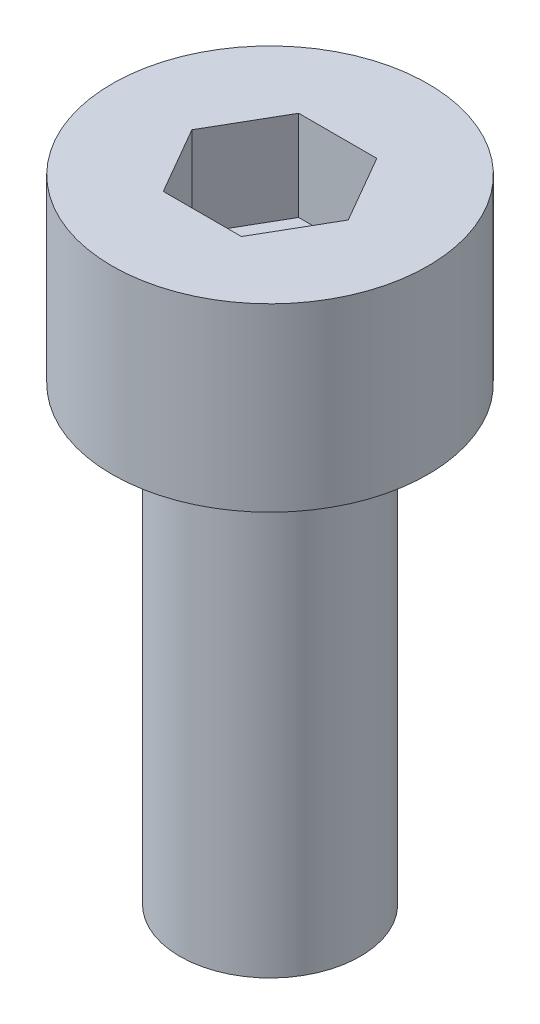
ISO-10303-21;
HEADER;
FILE_DESCRIPTION(('STEP AP214'),'2;1');
FILE_NAME('part.step','',(''),(''),'','','');
FILE_SCHEMA(('AUTOMOTIVE_DESIGN { 1 0 10303 214 1 1 1 1 }'));
ENDSEC;
DATA;
#1=APPLICATION_CONTEXT('core data for automotive mechanical design processes');
#2=APPLICATION_PROTOCOL_DEFINITION('international standard','automotive_design',2000,#1);
#3=PRODUCT_CONTEXT('',#1,'mechanical');
#4=PRODUCT('Part','Part','',(#3));
#5=PRODUCT_RELATED_PRODUCT_CATEGORY('part','',(#4));
#6=PRODUCT_DEFINITION_FORMATION('','',#4);
#7=PRODUCT_DEFINITION_CONTEXT('part definition',#1,'design');
#8=PRODUCT_DEFINITION('design','',#6,#7);
#9=PRODUCT_DEFINITION_SHAPE('','',#8);
#10=(LENGTH_UNIT() NAMED_UNIT(*) SI_UNIT(.MILLI.,.METRE.));
#11=(NAMED_UNIT(*) PLANE_ANGLE_UNIT() SI_UNIT($,.RADIAN.));
#12=(NAMED_UNIT(*) SI_UNIT($,.STERADIAN.) SOLID_ANGLE_UNIT());
#13=UNCERTAINTY_MEASURE_WITH_UNIT(LENGTH_MEASURE(1.E-05),#10,'distance_accuracy_value','');
#14=(GEOMETRIC_REPRESENTATION_CONTEXT(3) GLOBAL_UNCERTAINTY_ASSIGNED_CONTEXT((#13)) GLOBAL_UNIT_ASSIGNED_CONTEXT((#10,
#11,#12)) REPRESENTATION_CONTEXT('',''));
#15=CARTESIAN_POINT('',(0.,0.,0.));
#16=DIRECTION('',(0.,0.,1.));
#17=DIRECTION('',(1.,0.,0.));
#18=AXIS2_PLACEMENT_3D('',#15,#16,#17);
#19=CARTESIAN_POINT('',(0.,4.,0.));
#20=DIRECTION('',(0.,-1.,0.));
#21=DIRECTION('',(0.,0.,-1.));
#22=AXIS2_PLACEMENT_3D('',#19,#20,#21);
#23=CYLINDRICAL_SURFACE('',#22,3.5);
#24=CARTESIAN_POINT('',(0.,4.,0.));
#25=DIRECTION('',(0.,1.,0.));
#26=DIRECTION('',(0.,0.,1.));
#27=AXIS2_PLACEMENT_3D('',#24,#25,#26);
#28=CIRCLE('',#27,3.5);
#29=CARTESIAN_POINT('',(0.,4.,3.5));
#30=VERTEX_POINT('',#29);
#31=EDGE_CURVE('E47',#30,#30,#28,.T.);
#32=ORIENTED_EDGE('',*,*,#31,.F.);
#33=EDGE_LOOP('',(#32));
#34=FACE_BOUND('',#33,.T.);
#35=CARTESIAN_POINT('',(0.,0.,0.));
#36=DIRECTION('',(0.,1.,0.));
#37=DIRECTION('',(0.,0.,1.));
#38=AXIS2_PLACEMENT_3D('',#35,#36,#37);
#39=CIRCLE('',#38,3.5);
#40=CARTESIAN_POINT('',(0.,0.,3.5));
#41=VERTEX_POINT('',#40);
#42=EDGE_CURVE('E42',#41,#41,#39,.T.);
#43=ORIENTED_EDGE('',*,*,#42,.T.);
#44=EDGE_LOOP('',(#43));
#45=FACE_BOUND('',#44,.T.);
#46=ADVANCED_FACE('F39',(#34,#45),#23,.T.);
#47=CARTESIAN_POINT('',(0.,4.,0.));
#48=DIRECTION('',(0.,1.,0.));
#49=DIRECTION('',(0.,0.,1.));
#50=AXIS2_PLACEMENT_3D('',#47,#48,#49);
#51=PLANE('',#50);
#52=DIRECTION('',(0.5,0.,-0.866025403784439));
#53=VECTOR('',#52,1.);
#54=CARTESIAN_POINT('',(0.866025403784438,4.,1.5));
#55=LINE('',#54,#53);
#56=CARTESIAN_POINT('',(0.866025403784438,4.,1.5));
#57=VERTEX_POINT('',#56);
#58=CARTESIAN_POINT('',(1.73205080756888,4.,0.));
#59=VERTEX_POINT('',#58);
#60=EDGE_CURVE('E55',#57,#59,#55,.T.);
#61=ORIENTED_EDGE('',*,*,#60,.F.);
#62=DIRECTION('',(1.,0.,0.));
#63=VECTOR('',#62,1.);
#64=CARTESIAN_POINT('',(-0.866025403784439,4.,1.5));
#65=LINE('',#64,#63);
#66=CARTESIAN_POINT('',(-0.866025403784439,4.,1.5));
#67=VERTEX_POINT('',#66);
#68=EDGE_CURVE('E139',#67,#57,#65,.T.);
#69=ORIENTED_EDGE('',*,*,#68,.F.);
#70=DIRECTION('',(0.5,0.,0.866025403784438));
#71=VECTOR('',#70,1.);
#72=CARTESIAN_POINT('',(-1.73205080756888,4.,0.));
#73=LINE('',#72,#71);
#74=CARTESIAN_POINT('',(-1.73205080756888,4.,0.));
#75=VERTEX_POINT('',#74);
#76=EDGE_CURVE('E137',#75,#67,#73,.T.);
#77=ORIENTED_EDGE('',*,*,#76,.F.);
#78=DIRECTION('',(-0.5,0.,0.866025403784439));
#79=VECTOR('',#78,1.);
#80=CARTESIAN_POINT('',(-0.866025403784439,4.,-1.5));
#81=LINE('',#80,#79);
#82=CARTESIAN_POINT('',(-0.866025403784439,4.,-1.5));
#83=VERTEX_POINT('',#82);
#84=EDGE_CURVE('E103',#83,#75,#81,.T.);
#85=ORIENTED_EDGE('',*,*,#84,.F.);
#86=DIRECTION('',(-1.,0.,0.));
#87=VECTOR('',#86,1.);
#88=CARTESIAN_POINT('',(0.866025403784438,4.,-1.5));
#89=LINE('',#88,#87);
#90=CARTESIAN_POINT('',(0.866025403784438,4.,-1.5));
#91=VERTEX_POINT('',#90);
#92=EDGE_CURVE('E133',#91,#83,#89,.T.);
#93=ORIENTED_EDGE('',*,*,#92,.F.);
#94=DIRECTION('',(-0.5,0.,-0.866025403784439));
#95=VECTOR('',#94,1.);
#96=CARTESIAN_POINT('',(1.73205080756888,4.,0.));
#97=LINE('',#96,#95);
#98=EDGE_CURVE('E129',#59,#91,#97,.T.);
#99=ORIENTED_EDGE('',*,*,#98,.F.);
#100=EDGE_LOOP('',(#61,#69,#77,#85,#93,#99));
#101=FACE_BOUND('',#100,.T.);
#102=ORIENTED_EDGE('',*,*,#31,.T.);
#103=EDGE_LOOP('',(#102));
#104=FACE_BOUND('',#103,.T.);
#105=ADVANCED_FACE('F157',(#101,#104),#51,.T.);
#106=CARTESIAN_POINT('',(0.,0.,0.));
#107=DIRECTION('',(0.,1.,0.));
#108=DIRECTION('',(0.,0.,1.));
#109=AXIS2_PLACEMENT_3D('',#106,#107,#108);
#110=PLANE('',#109);
#111=CARTESIAN_POINT('',(0.,0.,0.));
#112=DIRECTION('',(0.,-1.,0.));
#113=DIRECTION('',(0.,0.,-1.));
#114=AXIS2_PLACEMENT_3D('',#111,#112,#113);
#115=CIRCLE('',#114,2.);
#116=CARTESIAN_POINT('',(0.,0.,-2.));
#117=VERTEX_POINT('',#116);
#118=EDGE_CURVE('E11',#117,#117,#115,.T.);
#119=ORIENTED_EDGE('',*,*,#118,.F.);
#120=EDGE_LOOP('',(#119));
#121=FACE_BOUND('',#120,.T.);
#122=ORIENTED_EDGE('',*,*,#42,.F.);
#123=EDGE_LOOP('',(#122));
#124=FACE_BOUND('',#123,.T.);
#125=ADVANCED_FACE('F154',(#121,#124),#110,.F.);
#126=CARTESIAN_POINT('',(0.866025403784438,2.,1.5));
#127=DIRECTION('',(0.866025403784439,0.,0.5));
#128=DIRECTION('',(0.5,0.,-0.866025403784439));
#129=AXIS2_PLACEMENT_3D('',#126,#127,#128);
#130=PLANE('',#129);
#131=ORIENTED_EDGE('',*,*,#60,.T.);
#132=DIRECTION('',(0.,1.,0.));
#133=VECTOR('',#132,1.);
#134=CARTESIAN_POINT('',(1.73205080756888,2.,0.));
#135=LINE('',#134,#133);
#136=CARTESIAN_POINT('',(1.73205080756888,2.,0.));
#137=VERTEX_POINT('',#136);
#138=EDGE_CURVE('E85',#137,#59,#135,.T.);
#139=ORIENTED_EDGE('',*,*,#138,.F.);
#140=DIRECTION('',(0.5,0.,-0.866025403784439));
#141=VECTOR('',#140,1.);
#142=CARTESIAN_POINT('',(0.866025403784438,2.,1.5));
#143=LINE('',#142,#141);
#144=CARTESIAN_POINT('',(0.866025403784438,2.,1.5));
#145=VERTEX_POINT('',#144);
#146=EDGE_CURVE('E141',#145,#137,#143,.T.);
#147=ORIENTED_EDGE('',*,*,#146,.F.);
#148=DIRECTION('',(0.,1.,0.));
#149=VECTOR('',#148,1.);
#150=CARTESIAN_POINT('',(0.866025403784438,2.,1.5));
#151=LINE('',#150,#149);
#152=EDGE_CURVE('E63',#145,#57,#151,.T.);
#153=ORIENTED_EDGE('',*,*,#152,.T.);
#154=EDGE_LOOP('',(#131,#139,#147,#153));
#155=FACE_BOUND('',#154,.T.);
#156=ADVANCED_FACE('F156',(#155),#130,.F.);
#157=CARTESIAN_POINT('',(-0.866025403784439,2.,1.5));
#158=DIRECTION('',(0.,0.,1.));
#159=DIRECTION('',(1.,0.,0.));
#160=AXIS2_PLACEMENT_3D('',#157,#158,#159);
#161=PLANE('',#160);
#162=ORIENTED_EDGE('',*,*,#68,.T.);
#163=ORIENTED_EDGE('',*,*,#152,.F.);
#164=DIRECTION('',(1.,0.,0.));
#165=VECTOR('',#164,1.);
#166=CARTESIAN_POINT('',(-0.866025403784439,2.,1.5));
#167=LINE('',#166,#165);
#168=CARTESIAN_POINT('',(-0.866025403784439,2.,1.5));
#169=VERTEX_POINT('',#168);
#170=EDGE_CURVE('E115',#169,#145,#167,.T.);
#171=ORIENTED_EDGE('',*,*,#170,.F.);
#172=DIRECTION('',(0.,1.,0.));
#173=VECTOR('',#172,1.);
#174=CARTESIAN_POINT('',(-0.866025403784439,2.,1.5));
#175=LINE('',#174,#173);
#176=EDGE_CURVE('E107',#169,#67,#175,.T.);
#177=ORIENTED_EDGE('',*,*,#176,.T.);
#178=EDGE_LOOP('',(#162,#163,#171,#177));
#179=FACE_BOUND('',#178,.T.);
#180=ADVANCED_FACE('F163',(#179),#161,.F.);
#181=CARTESIAN_POINT('',(-1.73205080756888,2.,0.));
#182=DIRECTION('',(-0.866025403784439,0.,0.5));
#183=DIRECTION('',(0.5,0.,0.866025403784438));
#184=AXIS2_PLACEMENT_3D('',#181,#182,#183);
#185=PLANE('',#184);
#186=ORIENTED_EDGE('',*,*,#76,.T.);
#187=ORIENTED_EDGE('',*,*,#176,.F.);
#188=DIRECTION('',(0.5,0.,0.866025403784438));
#189=VECTOR('',#188,1.);
#190=CARTESIAN_POINT('',(-1.73205080756888,2.,0.));
#191=LINE('',#190,#189);
#192=CARTESIAN_POINT('',(-1.73205080756888,2.,0.));
#193=VERTEX_POINT('',#192);
#194=EDGE_CURVE('E111',#193,#169,#191,.T.);
#195=ORIENTED_EDGE('',*,*,#194,.F.);
#196=DIRECTION('',(0.,1.,0.));
#197=VECTOR('',#196,1.);
#198=CARTESIAN_POINT('',(-1.73205080756888,2.,0.));
#199=LINE('',#198,#197);
#200=EDGE_CURVE('E96',#193,#75,#199,.T.);
#201=ORIENTED_EDGE('',*,*,#200,.T.);
#202=EDGE_LOOP('',(#186,#187,#195,#201));
#203=FACE_BOUND('',#202,.T.);
#204=ADVANCED_FACE('F112',(#203),#185,.F.);
#205=CARTESIAN_POINT('',(-0.866025403784439,2.,-1.5));
#206=DIRECTION('',(-0.866025403784439,0.,-0.5));
#207=DIRECTION('',(-0.5,0.,0.866025403784439));
#208=AXIS2_PLACEMENT_3D('',#205,#206,#207);
#209=PLANE('',#208);
#210=ORIENTED_EDGE('',*,*,#84,.T.);
#211=ORIENTED_EDGE('',*,*,#200,.F.);
#212=DIRECTION('',(-0.5,0.,0.866025403784439));
#213=VECTOR('',#212,1.);
#214=CARTESIAN_POINT('',(-0.866025403784439,2.,-1.5));
#215=LINE('',#214,#213);
#216=CARTESIAN_POINT('',(-0.866025403784439,2.,-1.5));
#217=VERTEX_POINT('',#216);
#218=EDGE_CURVE('E100',#217,#193,#215,.T.);
#219=ORIENTED_EDGE('',*,*,#218,.F.);
#220=DIRECTION('',(0.,1.,0.));
#221=VECTOR('',#220,1.);
#222=CARTESIAN_POINT('',(-0.866025403784439,2.,-1.5));
#223=LINE('',#222,#221);
#224=EDGE_CURVE('E108',#217,#83,#223,.T.);
#225=ORIENTED_EDGE('',*,*,#224,.T.);
#226=EDGE_LOOP('',(#210,#211,#219,#225));
#227=FACE_BOUND('',#226,.T.);
#228=ADVANCED_FACE('F98',(#227),#209,.F.);
#229=CARTESIAN_POINT('',(0.866025403784438,2.,-1.5));
#230=DIRECTION('',(0.,0.,-1.));
#231=DIRECTION('',(-1.,0.,0.));
#232=AXIS2_PLACEMENT_3D('',#229,#230,#231);
#233=PLANE('',#232);
#234=ORIENTED_EDGE('',*,*,#92,.T.);
#235=ORIENTED_EDGE('',*,*,#224,.F.);
#236=DIRECTION('',(-1.,0.,0.));
#237=VECTOR('',#236,1.);
#238=CARTESIAN_POINT('',(0.866025403784438,2.,-1.5));
#239=LINE('',#238,#237);
#240=CARTESIAN_POINT('',(0.866025403784438,2.,-1.5));
#241=VERTEX_POINT('',#240);
#242=EDGE_CURVE('E121',#241,#217,#239,.T.);
#243=ORIENTED_EDGE('',*,*,#242,.F.);
#244=DIRECTION('',(0.,1.,0.));
#245=VECTOR('',#244,1.);
#246=CARTESIAN_POINT('',(0.866025403784438,2.,-1.5));
#247=LINE('',#246,#245);
#248=EDGE_CURVE('E145',#241,#91,#247,.T.);
#249=ORIENTED_EDGE('',*,*,#248,.T.);
#250=EDGE_LOOP('',(#234,#235,#243,#249));
#251=FACE_BOUND('',#250,.T.);
#252=ADVANCED_FACE('F208',(#251),#233,.F.);
#253=CARTESIAN_POINT('',(1.73205080756888,2.,0.));
#254=DIRECTION('',(0.866025403784439,0.,-0.5));
#255=DIRECTION('',(-0.5,0.,-0.866025403784439));
#256=AXIS2_PLACEMENT_3D('',#253,#254,#255);
#257=PLANE('',#256);
#258=ORIENTED_EDGE('',*,*,#98,.T.);
#259=ORIENTED_EDGE('',*,*,#248,.F.);
#260=DIRECTION('',(-0.5,0.,-0.866025403784439));
#261=VECTOR('',#260,1.);
#262=CARTESIAN_POINT('',(1.73205080756888,2.,0.));
#263=LINE('',#262,#261);
#264=EDGE_CURVE('E123',#137,#241,#263,.T.);
#265=ORIENTED_EDGE('',*,*,#264,.F.);
#266=ORIENTED_EDGE('',*,*,#138,.T.);
#267=EDGE_LOOP('',(#258,#259,#265,#266));
#268=FACE_BOUND('',#267,.T.);
#269=ADVANCED_FACE('F217',(#268),#257,.F.);
#270=CARTESIAN_POINT('',(0.,2.,0.));
#271=DIRECTION('',(0.,1.,0.));
#272=DIRECTION('',(0.,0.,1.));
#273=AXIS2_PLACEMENT_3D('',#270,#271,#272);
#274=PLANE('',#273);
#275=ORIENTED_EDGE('',*,*,#146,.T.);
#276=ORIENTED_EDGE('',*,*,#264,.T.);
#277=ORIENTED_EDGE('',*,*,#242,.T.);
#278=ORIENTED_EDGE('',*,*,#218,.T.);
#279=ORIENTED_EDGE('',*,*,#194,.T.);
#280=ORIENTED_EDGE('',*,*,#170,.T.);
#281=EDGE_LOOP('',(#275,#276,#277,#278,#279,#280));
#282=FACE_BOUND('',#281,.T.);
#283=ADVANCED_FACE('F118',(#282),#274,.T.);
#284=CARTESIAN_POINT('',(0.,-10.,0.));
#285=DIRECTION('',(0.,1.,0.));
#286=DIRECTION('',(0.,0.,1.));
#287=AXIS2_PLACEMENT_3D('',#284,#285,#286);
#288=CYLINDRICAL_SURFACE('',#287,2.);
#289=CARTESIAN_POINT('',(0.,-10.,0.));
#290=DIRECTION('',(0.,-1.,0.));
#291=DIRECTION('',(0.,0.,-1.));
#292=AXIS2_PLACEMENT_3D('',#289,#290,#291);
#293=CIRCLE('',#292,2.);
#294=CARTESIAN_POINT('',(0.,-10.,-2.));
#295=VERTEX_POINT('',#294);
#296=EDGE_CURVE('E130',#295,#295,#293,.T.);
#297=ORIENTED_EDGE('',*,*,#296,.F.);
#298=EDGE_LOOP('',(#297));
#299=FACE_BOUND('',#298,.T.);
#300=ORIENTED_EDGE('',*,*,#118,.T.);
#301=EDGE_LOOP('',(#300));
#302=FACE_BOUND('',#301,.T.);
#303=ADVANCED_FACE('F235',(#299,#302),#288,.T.);
#304=CARTESIAN_POINT('',(0.,-10.,0.));
#305=DIRECTION('',(0.,-1.,0.));
#306=DIRECTION('',(0.,0.,-1.));
#307=AXIS2_PLACEMENT_3D('',#304,#305,#306);
#308=PLANE('',#307);
#309=ORIENTED_EDGE('',*,*,#296,.T.);
#310=EDGE_LOOP('',(#309));
#311=FACE_BOUND('',#310,.T.);
#312=ADVANCED_FACE('F248',(#311),#308,.T.);
#313=CLOSED_SHELL('',(#46,#105,#125,#156,#180,#204,#228,#252,#269,#283,#303,#312));
#314=MANIFOLD_SOLID_BREP('B2',#313);
#315=ADVANCED_BREP_SHAPE_REPRESENTATION('',(#18,#314),#14);
#316=SHAPE_DEFINITION_REPRESENTATION(#9,#315);
ENDSEC;
END-ISO-10303-21;
